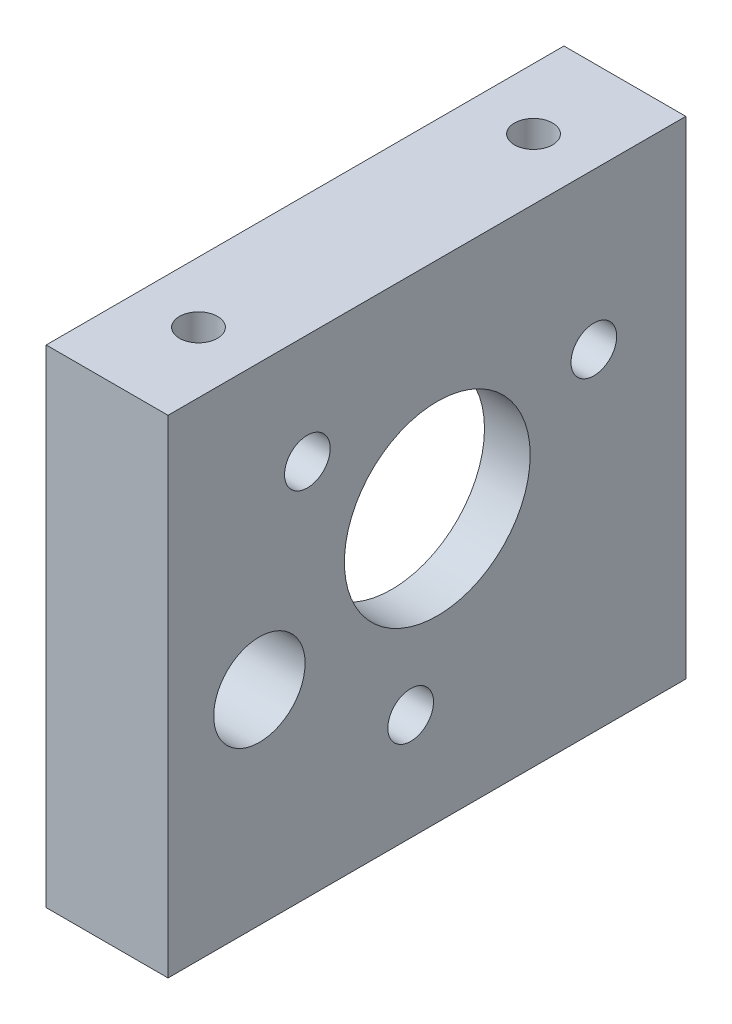
ISO-10303-21;
HEADER;
FILE_DESCRIPTION(('STEP AP214'),'2;1');
FILE_NAME('part.step','',(''),(''),'','','');
FILE_SCHEMA(('AUTOMOTIVE_DESIGN { 1 0 10303 214 1 1 1 1 }'));
ENDSEC;
DATA;
#1=APPLICATION_CONTEXT('core data for automotive mechanical design processes');
#2=APPLICATION_PROTOCOL_DEFINITION('international standard','automotive_design',2000,#1);
#3=PRODUCT_CONTEXT('',#1,'mechanical');
#4=PRODUCT('Part','Part','',(#3));
#5=PRODUCT_RELATED_PRODUCT_CATEGORY('part','',(#4));
#6=PRODUCT_DEFINITION_FORMATION('','',#4);
#7=PRODUCT_DEFINITION_CONTEXT('part definition',#1,'design');
#8=PRODUCT_DEFINITION('design','',#6,#7);
#9=PRODUCT_DEFINITION_SHAPE('','',#8);
#10=(LENGTH_UNIT() NAMED_UNIT(*) SI_UNIT(.MILLI.,.METRE.));
#11=(NAMED_UNIT(*) PLANE_ANGLE_UNIT() SI_UNIT($,.RADIAN.));
#12=(NAMED_UNIT(*) SI_UNIT($,.STERADIAN.) SOLID_ANGLE_UNIT());
#13=UNCERTAINTY_MEASURE_WITH_UNIT(LENGTH_MEASURE(1.E-05),#10,'distance_accuracy_value','');
#14=(GEOMETRIC_REPRESENTATION_CONTEXT(3) GLOBAL_UNCERTAINTY_ASSIGNED_CONTEXT((#13)) GLOBAL_UNIT_ASSIGNED_CONTEXT((#10,
#11,#12)) REPRESENTATION_CONTEXT('',''));
#15=CARTESIAN_POINT('',(0.,0.,0.));
#16=DIRECTION('',(0.,0.,1.));
#17=DIRECTION('',(1.,0.,0.));
#18=AXIS2_PLACEMENT_3D('',#15,#16,#17);
#19=CARTESIAN_POINT('',(0.,0.,0.));
#20=DIRECTION('',(-1.,0.,0.));
#21=DIRECTION('',(0.,0.,1.));
#22=AXIS2_PLACEMENT_3D('',#19,#20,#21);
#23=PLANE('',#22);
#24=DIRECTION('',(0.,-1.,0.));
#25=VECTOR('',#24,1.);
#26=CARTESIAN_POINT('',(0.,0.,0.));
#27=LINE('',#26,#25);
#28=CARTESIAN_POINT('',(0.,32.,0.));
#29=VERTEX_POINT('',#28);
#30=CARTESIAN_POINT('',(0.,0.,0.));
#31=VERTEX_POINT('',#30);
#32=EDGE_CURVE('E297',#29,#31,#27,.T.);
#33=ORIENTED_EDGE('',*,*,#32,.F.);
#34=DIRECTION('',(0.,0.,1.));
#35=VECTOR('',#34,1.);
#36=CARTESIAN_POINT('',(0.,32.,0.));
#37=LINE('',#36,#35);
#38=CARTESIAN_POINT('',(0.,32.,-34.));
#39=VERTEX_POINT('',#38);
#40=EDGE_CURVE('E83',#39,#29,#37,.T.);
#41=ORIENTED_EDGE('',*,*,#40,.F.);
#42=DIRECTION('',(0.,1.,0.));
#43=VECTOR('',#42,1.);
#44=CARTESIAN_POINT('',(0.,0.,-34.));
#45=LINE('',#44,#43);
#46=CARTESIAN_POINT('',(0.,0.,-34.));
#47=VERTEX_POINT('',#46);
#48=EDGE_CURVE('E309',#47,#39,#45,.T.);
#49=ORIENTED_EDGE('',*,*,#48,.F.);
#50=DIRECTION('',(0.,0.,-1.));
#51=VECTOR('',#50,1.);
#52=CARTESIAN_POINT('',(0.,0.,0.));
#53=LINE('',#52,#51);
#54=EDGE_CURVE('E307',#31,#47,#53,.T.);
#55=ORIENTED_EDGE('',*,*,#54,.F.);
#56=EDGE_LOOP('',(#33,#41,#49,#55));
#57=FACE_BOUND('',#56,.T.);
#58=CARTESIAN_POINT('',(0.,13.4,-6.));
#59=DIRECTION('',(-1.,0.,0.));
#60=DIRECTION('',(0.,0.,1.));
#61=AXIS2_PLACEMENT_3D('',#58,#59,#60);
#62=CIRCLE('',#61,3.);
#63=CARTESIAN_POINT('',(0.,13.4,-3.));
#64=VERTEX_POINT('',#63);
#65=EDGE_CURVE('E288',#64,#64,#62,.F.);
#66=ORIENTED_EDGE('',*,*,#65,.T.);
#67=EDGE_LOOP('',(#66));
#68=FACE_BOUND('',#67,.T.);
#69=CARTESIAN_POINT('',(0.,21.8852813742386,-9.));
#70=DIRECTION('',(1.,0.,0.));
#71=DIRECTION('',(0.,0.,1.));
#72=AXIS2_PLACEMENT_3D('',#69,#70,#71);
#73=CIRCLE('',#72,3.);
#74=CARTESIAN_POINT('',(0.,21.8852813742386,-6.));
#75=VERTEX_POINT('',#74);
#76=CARTESIAN_POINT('',(0.,19.0568542494924,-8.));
#77=VERTEX_POINT('',#76);
#78=EDGE_CURVE('E204',#75,#77,#73,.T.);
#79=ORIENTED_EDGE('',*,*,#78,.T.);
#80=CARTESIAN_POINT('',(0.,13.4,-6.));
#81=DIRECTION('',(-1.,0.,0.));
#82=DIRECTION('',(0.,0.,-1.));
#83=AXIS2_PLACEMENT_3D('',#80,#81,#82);
#84=CIRCLE('',#83,6.);
#85=CARTESIAN_POINT('',(0.,13.4,-12.));
#86=VERTEX_POINT('',#85);
#87=EDGE_CURVE('E53',#77,#86,#84,.T.);
#88=ORIENTED_EDGE('',*,*,#87,.T.);
#89=DIRECTION('',(0.,-1.,0.));
#90=VECTOR('',#89,1.);
#91=CARTESIAN_POINT('',(0.,7.,-12.));
#92=LINE('',#91,#90);
#93=CARTESIAN_POINT('',(0.,7.,-12.));
#94=VERTEX_POINT('',#93);
#95=EDGE_CURVE('E226',#86,#94,#92,.T.);
#96=ORIENTED_EDGE('',*,*,#95,.T.);
#97=CARTESIAN_POINT('',(0.,7.,-15.));
#98=DIRECTION('',(1.,0.,0.));
#99=DIRECTION('',(0.,0.,1.));
#100=AXIS2_PLACEMENT_3D('',#97,#98,#99);
#101=CIRCLE('',#100,3.);
#102=CARTESIAN_POINT('',(0.,4.,-15.));
#103=VERTEX_POINT('',#102);
#104=EDGE_CURVE('E229',#94,#103,#101,.T.);
#105=ORIENTED_EDGE('',*,*,#104,.T.);
#106=DIRECTION('',(0.,0.,-1.));
#107=VECTOR('',#106,1.);
#108=CARTESIAN_POINT('',(0.,4.,-29.));
#109=LINE('',#108,#107);
#110=CARTESIAN_POINT('',(0.,4.,-29.));
#111=VERTEX_POINT('',#110);
#112=EDGE_CURVE('E232',#103,#111,#109,.T.);
#113=ORIENTED_EDGE('',*,*,#112,.T.);
#114=CARTESIAN_POINT('',(0.,7.,-29.));
#115=DIRECTION('',(1.,0.,0.));
#116=DIRECTION('',(0.,0.,1.));
#117=AXIS2_PLACEMENT_3D('',#114,#115,#116);
#118=CIRCLE('',#117,3.);
#119=CARTESIAN_POINT('',(0.,7.00000000000002,-32.));
#120=VERTEX_POINT('',#119);
#121=EDGE_CURVE('E235',#111,#120,#118,.T.);
#122=ORIENTED_EDGE('',*,*,#121,.T.);
#123=DIRECTION('',(0.,1.,0.));
#124=VECTOR('',#123,1.);
#125=CARTESIAN_POINT('',(0.,25.,-32.));
#126=LINE('',#125,#124);
#127=CARTESIAN_POINT('',(0.,25.,-32.));
#128=VERTEX_POINT('',#127);
#129=EDGE_CURVE('E238',#120,#128,#126,.T.);
#130=ORIENTED_EDGE('',*,*,#129,.T.);
#131=CARTESIAN_POINT('',(0.,25.,-29.));
#132=DIRECTION('',(1.,0.,0.));
#133=DIRECTION('',(0.,0.,-1.));
#134=AXIS2_PLACEMENT_3D('',#131,#132,#133);
#135=CIRCLE('',#134,3.);
#136=CARTESIAN_POINT('',(0.,28.,-29.));
#137=VERTEX_POINT('',#136);
#138=EDGE_CURVE('E241',#128,#137,#135,.T.);
#139=ORIENTED_EDGE('',*,*,#138,.T.);
#140=DIRECTION('',(0.,0.,1.));
#141=VECTOR('',#140,1.);
#142=CARTESIAN_POINT('',(0.,28.,-9.));
#143=LINE('',#142,#141);
#144=CARTESIAN_POINT('',(0.,28.,-9.));
#145=VERTEX_POINT('',#144);
#146=EDGE_CURVE('E244',#137,#145,#143,.T.);
#147=ORIENTED_EDGE('',*,*,#146,.T.);
#148=CARTESIAN_POINT('',(0.,25.,-9.));
#149=DIRECTION('',(1.,0.,0.));
#150=DIRECTION('',(0.,0.,1.));
#151=AXIS2_PLACEMENT_3D('',#148,#149,#150);
#152=CIRCLE('',#151,3.);
#153=CARTESIAN_POINT('',(0.,25.,-6.));
#154=VERTEX_POINT('',#153);
#155=EDGE_CURVE('E247',#145,#154,#152,.T.);
#156=ORIENTED_EDGE('',*,*,#155,.T.);
#157=DIRECTION('',(0.,-1.,0.));
#158=VECTOR('',#157,1.);
#159=CARTESIAN_POINT('',(0.,21.8852813742386,-6.));
#160=LINE('',#159,#158);
#161=EDGE_CURVE('E250',#154,#75,#160,.T.);
#162=ORIENTED_EDGE('',*,*,#161,.T.);
#163=EDGE_LOOP('',(#79,#88,#96,#105,#113,#122,#130,#139,#147,#156,#162));
#164=FACE_BOUND('',#163,.T.);
#165=ADVANCED_FACE('F37',(#57,#68,#164),#23,.T.);
#166=CARTESIAN_POINT('',(-0.000999999999999265,6.98982565886287,-15.9327571658744));
#167=DIRECTION('',(1.,0.,0.));
#168=DIRECTION('',(0.,-0.866025403784443,0.499999999999992));
#169=AXIS2_PLACEMENT_3D('',#166,#167,#168);
#170=CYLINDRICAL_SURFACE('',#169,1.50000000000001);
#171=CARTESIAN_POINT('',(5.,6.98982565886287,-15.9327571658744));
#172=DIRECTION('',(1.,0.,0.));
#173=DIRECTION('',(0.,0.,-1.));
#174=AXIS2_PLACEMENT_3D('',#171,#172,#173);
#175=CIRCLE('',#174,1.50000000000001);
#176=CARTESIAN_POINT('',(5.,6.98982565886287,-17.4327571658744));
#177=VERTEX_POINT('',#176);
#178=EDGE_CURVE('E282',#177,#177,#175,.F.);
#179=ORIENTED_EDGE('',*,*,#178,.T.);
#180=EDGE_LOOP('',(#179));
#181=FACE_BOUND('',#180,.T.);
#182=CARTESIAN_POINT('',(8.,6.98982565886287,-15.9327571658744));
#183=DIRECTION('',(1.,0.,0.));
#184=DIRECTION('',(0.,-0.866025403784443,0.499999999999992));
#185=AXIS2_PLACEMENT_3D('',#182,#183,#184);
#186=CIRCLE('',#185,1.50000000000001);
#187=CARTESIAN_POINT('',(8.,5.6907875531862,-15.1827571658744));
#188=VERTEX_POINT('',#187);
#189=EDGE_CURVE('E11',#188,#188,#186,.T.);
#190=ORIENTED_EDGE('',*,*,#189,.T.);
#191=EDGE_LOOP('',(#190));
#192=FACE_BOUND('',#191,.T.);
#193=ADVANCED_FACE('F39',(#181,#192),#170,.F.);
#194=CARTESIAN_POINT('',(-0.000999999999999265,24.7941743411371,-9.15004620343455));
#195=DIRECTION('',(1.,0.,0.));
#196=DIRECTION('',(0.,0.866025403784436,0.500000000000004));
#197=AXIS2_PLACEMENT_3D('',#194,#195,#196);
#198=CYLINDRICAL_SURFACE('',#197,1.50000000000001);
#199=CARTESIAN_POINT('',(5.,24.7941743411371,-9.15004620343455));
#200=DIRECTION('',(1.,0.,0.));
#201=DIRECTION('',(0.,0.,-1.));
#202=AXIS2_PLACEMENT_3D('',#199,#200,#201);
#203=CIRCLE('',#202,1.50000000000001);
#204=CARTESIAN_POINT('',(5.,24.7941743411371,-10.6500462034346));
#205=VERTEX_POINT('',#204);
#206=EDGE_CURVE('E279',#205,#205,#203,.F.);
#207=ORIENTED_EDGE('',*,*,#206,.T.);
#208=EDGE_LOOP('',(#207));
#209=FACE_BOUND('',#208,.T.);
#210=CARTESIAN_POINT('',(8.,24.7941743411371,-9.15004620343455));
#211=DIRECTION('',(1.,0.,0.));
#212=DIRECTION('',(0.,0.866025403784436,0.500000000000004));
#213=AXIS2_PLACEMENT_3D('',#210,#211,#212);
#214=CIRCLE('',#213,1.50000000000001);
#215=CARTESIAN_POINT('',(8.,26.0932124468137,-8.40004620343454));
#216=VERTEX_POINT('',#215);
#217=EDGE_CURVE('E46',#216,#216,#214,.T.);
#218=ORIENTED_EDGE('',*,*,#217,.T.);
#219=EDGE_LOOP('',(#218));
#220=FACE_BOUND('',#219,.T.);
#221=ADVANCED_FACE('F323',(#209,#220),#198,.F.);
#222=CARTESIAN_POINT('',(8.,0.,0.));
#223=DIRECTION('',(0.,0.,-1.));
#224=DIRECTION('',(-1.,0.,0.));
#225=AXIS2_PLACEMENT_3D('',#222,#223,#224);
#226=PLANE('',#225);
#227=ORIENTED_EDGE('',*,*,#32,.T.);
#228=DIRECTION('',(-1.,0.,0.));
#229=VECTOR('',#228,1.);
#230=CARTESIAN_POINT('',(8.,0.,0.));
#231=LINE('',#230,#229);
#232=CARTESIAN_POINT('',(8.,0.,0.));
#233=VERTEX_POINT('',#232);
#234=EDGE_CURVE('E318',#233,#31,#231,.T.);
#235=ORIENTED_EDGE('',*,*,#234,.F.);
#236=DIRECTION('',(0.,-1.,0.));
#237=VECTOR('',#236,1.);
#238=CARTESIAN_POINT('',(8.,0.,0.));
#239=LINE('',#238,#237);
#240=CARTESIAN_POINT('',(8.,32.,0.));
#241=VERTEX_POINT('',#240);
#242=EDGE_CURVE('E298',#241,#233,#239,.T.);
#243=ORIENTED_EDGE('',*,*,#242,.F.);
#244=DIRECTION('',(-1.,0.,0.));
#245=VECTOR('',#244,1.);
#246=CARTESIAN_POINT('',(8.,32.,0.));
#247=LINE('',#246,#245);
#248=EDGE_CURVE('E304',#241,#29,#247,.T.);
#249=ORIENTED_EDGE('',*,*,#248,.T.);
#250=EDGE_LOOP('',(#227,#235,#243,#249));
#251=FACE_BOUND('',#250,.T.);
#252=ADVANCED_FACE('F340',(#251),#226,.F.);
#253=CARTESIAN_POINT('',(8.,0.,0.));
#254=DIRECTION('',(0.,1.,0.));
#255=DIRECTION('',(0.,0.,1.));
#256=AXIS2_PLACEMENT_3D('',#253,#254,#255);
#257=PLANE('',#256);
#258=CARTESIAN_POINT('',(4.,0.,-6.));
#259=DIRECTION('',(0.,-1.,0.));
#260=DIRECTION('',(0.,0.,-1.));
#261=AXIS2_PLACEMENT_3D('',#258,#259,#260);
#262=CIRCLE('',#261,1.24999999999999);
#263=CARTESIAN_POINT('',(4.,0.,-7.24999999999999));
#264=VERTEX_POINT('',#263);
#265=EDGE_CURVE('E178',#264,#264,#262,.T.);
#266=ORIENTED_EDGE('',*,*,#265,.F.);
#267=EDGE_LOOP('',(#266));
#268=FACE_BOUND('',#267,.T.);
#269=CARTESIAN_POINT('',(4.,0.,-28.));
#270=DIRECTION('',(0.,-1.,0.));
#271=DIRECTION('',(0.,0.,-1.));
#272=AXIS2_PLACEMENT_3D('',#269,#270,#271);
#273=CIRCLE('',#272,1.24999999999999);
#274=CARTESIAN_POINT('',(4.,0.,-29.25));
#275=VERTEX_POINT('',#274);
#276=EDGE_CURVE('E177',#275,#275,#273,.T.);
#277=ORIENTED_EDGE('',*,*,#276,.F.);
#278=EDGE_LOOP('',(#277));
#279=FACE_BOUND('',#278,.T.);
#280=ORIENTED_EDGE('',*,*,#54,.T.);
#281=DIRECTION('',(-1.,0.,0.));
#282=VECTOR('',#281,1.);
#283=CARTESIAN_POINT('',(8.,0.,-34.));
#284=LINE('',#283,#282);
#285=CARTESIAN_POINT('',(8.,0.,-34.));
#286=VERTEX_POINT('',#285);
#287=EDGE_CURVE('E315',#286,#47,#284,.T.);
#288=ORIENTED_EDGE('',*,*,#287,.F.);
#289=DIRECTION('',(0.,0.,-1.));
#290=VECTOR('',#289,1.);
#291=CARTESIAN_POINT('',(8.,0.,0.));
#292=LINE('',#291,#290);
#293=EDGE_CURVE('E91',#233,#286,#292,.T.);
#294=ORIENTED_EDGE('',*,*,#293,.F.);
#295=ORIENTED_EDGE('',*,*,#234,.T.);
#296=EDGE_LOOP('',(#280,#288,#294,#295));
#297=FACE_BOUND('',#296,.T.);
#298=ADVANCED_FACE('F342',(#268,#279,#297),#257,.F.);
#299=CARTESIAN_POINT('',(8.,0.,-34.));
#300=DIRECTION('',(0.,0.,1.));
#301=DIRECTION('',(1.,0.,0.));
#302=AXIS2_PLACEMENT_3D('',#299,#300,#301);
#303=PLANE('',#302);
#304=ORIENTED_EDGE('',*,*,#48,.T.);
#305=DIRECTION('',(-1.,0.,0.));
#306=VECTOR('',#305,1.);
#307=CARTESIAN_POINT('',(8.,32.,-34.));
#308=LINE('',#307,#306);
#309=CARTESIAN_POINT('',(8.,32.,-34.));
#310=VERTEX_POINT('',#309);
#311=EDGE_CURVE('E313',#310,#39,#308,.T.);
#312=ORIENTED_EDGE('',*,*,#311,.F.);
#313=DIRECTION('',(0.,1.,0.));
#314=VECTOR('',#313,1.);
#315=CARTESIAN_POINT('',(8.,0.,-34.));
#316=LINE('',#315,#314);
#317=EDGE_CURVE('E301',#286,#310,#316,.T.);
#318=ORIENTED_EDGE('',*,*,#317,.F.);
#319=ORIENTED_EDGE('',*,*,#287,.T.);
#320=EDGE_LOOP('',(#304,#312,#318,#319));
#321=FACE_BOUND('',#320,.T.);
#322=ADVANCED_FACE('F347',(#321),#303,.F.);
#323=CARTESIAN_POINT('',(8.,32.,0.));
#324=DIRECTION('',(0.,-1.,0.));
#325=DIRECTION('',(0.,0.,-1.));
#326=AXIS2_PLACEMENT_3D('',#323,#324,#325);
#327=PLANE('',#326);
#328=CARTESIAN_POINT('',(4.,32.,-6.));
#329=DIRECTION('',(0.,1.,0.));
#330=DIRECTION('',(0.,0.,1.));
#331=AXIS2_PLACEMENT_3D('',#328,#329,#330);
#332=CIRCLE('',#331,1.24999999999999);
#333=CARTESIAN_POINT('',(4.,32.,-4.75000000000001));
#334=VERTEX_POINT('',#333);
#335=EDGE_CURVE('E188',#334,#334,#332,.T.);
#336=ORIENTED_EDGE('',*,*,#335,.F.);
#337=EDGE_LOOP('',(#336));
#338=FACE_BOUND('',#337,.T.);
#339=CARTESIAN_POINT('',(4.,32.,-28.));
#340=DIRECTION('',(0.,1.,0.));
#341=DIRECTION('',(0.,0.,1.));
#342=AXIS2_PLACEMENT_3D('',#339,#340,#341);
#343=CIRCLE('',#342,1.24999999999999);
#344=CARTESIAN_POINT('',(4.,32.,-26.75));
#345=VERTEX_POINT('',#344);
#346=EDGE_CURVE('E194',#345,#345,#343,.T.);
#347=ORIENTED_EDGE('',*,*,#346,.F.);
#348=EDGE_LOOP('',(#347));
#349=FACE_BOUND('',#348,.T.);
#350=ORIENTED_EDGE('',*,*,#40,.T.);
#351=ORIENTED_EDGE('',*,*,#248,.F.);
#352=DIRECTION('',(0.,0.,1.));
#353=VECTOR('',#352,1.);
#354=CARTESIAN_POINT('',(8.,32.,0.));
#355=LINE('',#354,#353);
#356=EDGE_CURVE('E62',#310,#241,#355,.T.);
#357=ORIENTED_EDGE('',*,*,#356,.F.);
#358=ORIENTED_EDGE('',*,*,#311,.T.);
#359=EDGE_LOOP('',(#350,#351,#357,#358));
#360=FACE_BOUND('',#359,.T.);
#361=ADVANCED_FACE('F329',(#338,#349,#360),#327,.F.);
#362=CARTESIAN_POINT('',(8.,0.,0.));
#363=DIRECTION('',(-1.,0.,0.));
#364=DIRECTION('',(0.,0.,1.));
#365=AXIS2_PLACEMENT_3D('',#362,#363,#364);
#366=PLANE('',#365);
#367=ORIENTED_EDGE('',*,*,#189,.F.);
#368=EDGE_LOOP('',(#367));
#369=FACE_BOUND('',#368,.T.);
#370=ORIENTED_EDGE('',*,*,#217,.F.);
#371=EDGE_LOOP('',(#370));
#372=FACE_BOUND('',#371,.T.);
#373=CARTESIAN_POINT('',(8.,21.766,-27.9604199413399));
#374=DIRECTION('',(1.,0.,0.));
#375=DIRECTION('',(0.,0.,-1.));
#376=AXIS2_PLACEMENT_3D('',#373,#374,#375);
#377=CIRCLE('',#376,1.50000000000001);
#378=CARTESIAN_POINT('',(8.,21.766,-29.4604199413399));
#379=VERTEX_POINT('',#378);
#380=EDGE_CURVE('E285',#379,#379,#377,.T.);
#381=ORIENTED_EDGE('',*,*,#380,.F.);
#382=EDGE_LOOP('',(#381));
#383=FACE_BOUND('',#382,.T.);
#384=CARTESIAN_POINT('',(8.,13.4,-6.));
#385=DIRECTION('',(1.,0.,0.));
#386=DIRECTION('',(0.,0.,-1.));
#387=AXIS2_PLACEMENT_3D('',#384,#385,#386);
#388=CIRCLE('',#387,3.);
#389=CARTESIAN_POINT('',(8.,13.4,-9.));
#390=VERTEX_POINT('',#389);
#391=EDGE_CURVE('E289',#390,#390,#388,.T.);
#392=ORIENTED_EDGE('',*,*,#391,.F.);
#393=EDGE_LOOP('',(#392));
#394=FACE_BOUND('',#393,.T.);
#395=CARTESIAN_POINT('',(8.,17.85,-17.6810744368829));
#396=DIRECTION('',(1.,0.,0.));
#397=DIRECTION('',(0.,0.,-1.));
#398=AXIS2_PLACEMENT_3D('',#395,#396,#397);
#399=CIRCLE('',#398,6.10000000000001);
#400=CARTESIAN_POINT('',(8.,17.85,-23.7810744368829));
#401=VERTEX_POINT('',#400);
#402=EDGE_CURVE('E292',#401,#401,#399,.T.);
#403=ORIENTED_EDGE('',*,*,#402,.F.);
#404=EDGE_LOOP('',(#403));
#405=FACE_BOUND('',#404,.T.);
#406=ORIENTED_EDGE('',*,*,#242,.T.);
#407=ORIENTED_EDGE('',*,*,#293,.T.);
#408=ORIENTED_EDGE('',*,*,#317,.T.);
#409=ORIENTED_EDGE('',*,*,#356,.T.);
#410=EDGE_LOOP('',(#406,#407,#408,#409));
#411=FACE_BOUND('',#410,.T.);
#412=ADVANCED_FACE('F325',(#369,#372,#383,#394,#405,#411),#366,.F.);
#413=CARTESIAN_POINT('',(-0.000999999999999265,17.85,-17.6810744368829));
#414=DIRECTION('',(1.,0.,0.));
#415=DIRECTION('',(0.,0.,-1.));
#416=AXIS2_PLACEMENT_3D('',#413,#414,#415);
#417=CYLINDRICAL_SURFACE('',#416,6.10000000000001);
#418=CARTESIAN_POINT('',(5.,17.85,-17.6810744368829));
#419=DIRECTION('',(1.,0.,0.));
#420=DIRECTION('',(0.,0.,-1.));
#421=AXIS2_PLACEMENT_3D('',#418,#419,#420);
#422=CIRCLE('',#421,6.10000000000001);
#423=CARTESIAN_POINT('',(5.,17.85,-23.7810744368829));
#424=VERTEX_POINT('',#423);
#425=EDGE_CURVE('E276',#424,#424,#422,.F.);
#426=ORIENTED_EDGE('',*,*,#425,.T.);
#427=EDGE_LOOP('',(#426));
#428=FACE_BOUND('',#427,.T.);
#429=ORIENTED_EDGE('',*,*,#402,.T.);
#430=EDGE_LOOP('',(#429));
#431=FACE_BOUND('',#430,.T.);
#432=ADVANCED_FACE('F328',(#428,#431),#417,.F.);
#433=CARTESIAN_POINT('',(-0.000999999999999265,13.4,-6.));
#434=DIRECTION('',(1.,0.,0.));
#435=DIRECTION('',(0.,0.,-1.));
#436=AXIS2_PLACEMENT_3D('',#433,#434,#435);
#437=CYLINDRICAL_SURFACE('',#436,3.);
#438=ORIENTED_EDGE('',*,*,#65,.F.);
#439=EDGE_LOOP('',(#438));
#440=FACE_BOUND('',#439,.T.);
#441=ORIENTED_EDGE('',*,*,#391,.T.);
#442=EDGE_LOOP('',(#441));
#443=FACE_BOUND('',#442,.T.);
#444=ADVANCED_FACE('F437',(#440,#443),#437,.F.);
#445=CARTESIAN_POINT('',(-0.000999999999999265,21.766,-27.9604199413399));
#446=DIRECTION('',(1.,0.,0.));
#447=DIRECTION('',(0.,0.,-1.));
#448=AXIS2_PLACEMENT_3D('',#445,#446,#447);
#449=CYLINDRICAL_SURFACE('',#448,1.50000000000001);
#450=CARTESIAN_POINT('',(5.,21.766,-27.9604199413399));
#451=DIRECTION('',(1.,0.,0.));
#452=DIRECTION('',(0.,0.,-1.));
#453=AXIS2_PLACEMENT_3D('',#450,#451,#452);
#454=CIRCLE('',#453,1.50000000000001);
#455=CARTESIAN_POINT('',(5.,21.766,-29.4604199413399));
#456=VERTEX_POINT('',#455);
#457=EDGE_CURVE('E41',#456,#456,#454,.F.);
#458=ORIENTED_EDGE('',*,*,#457,.T.);
#459=EDGE_LOOP('',(#458));
#460=FACE_BOUND('',#459,.T.);
#461=ORIENTED_EDGE('',*,*,#380,.T.);
#462=EDGE_LOOP('',(#461));
#463=FACE_BOUND('',#462,.T.);
#464=ADVANCED_FACE('F434',(#460,#463),#449,.F.);
#465=CARTESIAN_POINT('',(5.,13.4,-6.));
#466=DIRECTION('',(1.,0.,0.));
#467=DIRECTION('',(0.,0.,-1.));
#468=AXIS2_PLACEMENT_3D('',#465,#466,#467);
#469=PLANE('',#468);
#470=ORIENTED_EDGE('',*,*,#206,.F.);
#471=EDGE_LOOP('',(#470));
#472=FACE_BOUND('',#471,.T.);
#473=ORIENTED_EDGE('',*,*,#457,.F.);
#474=EDGE_LOOP('',(#473));
#475=FACE_BOUND('',#474,.T.);
#476=CARTESIAN_POINT('',(5.,13.4,-6.));
#477=DIRECTION('',(-1.,0.,0.));
#478=DIRECTION('',(0.,0.,-1.));
#479=AXIS2_PLACEMENT_3D('',#476,#477,#478);
#480=CIRCLE('',#479,6.);
#481=CARTESIAN_POINT('',(5.,19.0568542494924,-8.));
#482=VERTEX_POINT('',#481);
#483=CARTESIAN_POINT('',(5.,13.4,-12.));
#484=VERTEX_POINT('',#483);
#485=EDGE_CURVE('E200',#482,#484,#480,.T.);
#486=ORIENTED_EDGE('',*,*,#485,.F.);
#487=CARTESIAN_POINT('',(5.,21.8852813742386,-9.));
#488=DIRECTION('',(1.,0.,0.));
#489=DIRECTION('',(0.,0.,1.));
#490=AXIS2_PLACEMENT_3D('',#487,#488,#489);
#491=CIRCLE('',#490,3.);
#492=CARTESIAN_POINT('',(5.,21.8852813742386,-6.));
#493=VERTEX_POINT('',#492);
#494=EDGE_CURVE('E222',#493,#482,#491,.T.);
#495=ORIENTED_EDGE('',*,*,#494,.F.);
#496=DIRECTION('',(0.,-1.,0.));
#497=VECTOR('',#496,1.);
#498=CARTESIAN_POINT('',(5.,21.8852813742386,-6.));
#499=LINE('',#498,#497);
#500=CARTESIAN_POINT('',(5.,25.,-6.));
#501=VERTEX_POINT('',#500);
#502=EDGE_CURVE('E220',#501,#493,#499,.T.);
#503=ORIENTED_EDGE('',*,*,#502,.F.);
#504=CARTESIAN_POINT('',(5.,25.,-9.));
#505=DIRECTION('',(1.,0.,0.));
#506=DIRECTION('',(0.,0.,1.));
#507=AXIS2_PLACEMENT_3D('',#504,#505,#506);
#508=CIRCLE('',#507,3.);
#509=CARTESIAN_POINT('',(5.,28.,-9.));
#510=VERTEX_POINT('',#509);
#511=EDGE_CURVE('E218',#510,#501,#508,.T.);
#512=ORIENTED_EDGE('',*,*,#511,.F.);
#513=DIRECTION('',(0.,0.,1.));
#514=VECTOR('',#513,1.);
#515=CARTESIAN_POINT('',(5.,28.,-9.));
#516=LINE('',#515,#514);
#517=CARTESIAN_POINT('',(5.,28.,-29.));
#518=VERTEX_POINT('',#517);
#519=EDGE_CURVE('E216',#518,#510,#516,.T.);
#520=ORIENTED_EDGE('',*,*,#519,.F.);
#521=CARTESIAN_POINT('',(5.,25.,-29.));
#522=DIRECTION('',(1.,0.,0.));
#523=DIRECTION('',(0.,0.,-1.));
#524=AXIS2_PLACEMENT_3D('',#521,#522,#523);
#525=CIRCLE('',#524,3.);
#526=CARTESIAN_POINT('',(5.,25.,-32.));
#527=VERTEX_POINT('',#526);
#528=EDGE_CURVE('E214',#527,#518,#525,.T.);
#529=ORIENTED_EDGE('',*,*,#528,.F.);
#530=DIRECTION('',(0.,1.,0.));
#531=VECTOR('',#530,1.);
#532=CARTESIAN_POINT('',(5.,25.,-32.));
#533=LINE('',#532,#531);
#534=CARTESIAN_POINT('',(5.,7.00000000000002,-32.));
#535=VERTEX_POINT('',#534);
#536=EDGE_CURVE('E212',#535,#527,#533,.T.);
#537=ORIENTED_EDGE('',*,*,#536,.F.);
#538=CARTESIAN_POINT('',(5.,7.,-29.));
#539=DIRECTION('',(1.,0.,0.));
#540=DIRECTION('',(0.,0.,1.));
#541=AXIS2_PLACEMENT_3D('',#538,#539,#540);
#542=CIRCLE('',#541,3.);
#543=CARTESIAN_POINT('',(5.,4.,-29.));
#544=VERTEX_POINT('',#543);
#545=EDGE_CURVE('E210',#544,#535,#542,.T.);
#546=ORIENTED_EDGE('',*,*,#545,.F.);
#547=DIRECTION('',(0.,0.,-1.));
#548=VECTOR('',#547,1.);
#549=CARTESIAN_POINT('',(5.,4.,-29.));
#550=LINE('',#549,#548);
#551=CARTESIAN_POINT('',(5.,4.,-15.));
#552=VERTEX_POINT('',#551);
#553=EDGE_CURVE('E208',#552,#544,#550,.T.);
#554=ORIENTED_EDGE('',*,*,#553,.F.);
#555=CARTESIAN_POINT('',(5.,7.,-15.));
#556=DIRECTION('',(1.,0.,0.));
#557=DIRECTION('',(0.,0.,1.));
#558=AXIS2_PLACEMENT_3D('',#555,#556,#557);
#559=CIRCLE('',#558,3.);
#560=CARTESIAN_POINT('',(5.,7.,-12.));
#561=VERTEX_POINT('',#560);
#562=EDGE_CURVE('E206',#561,#552,#559,.T.);
#563=ORIENTED_EDGE('',*,*,#562,.F.);
#564=DIRECTION('',(0.,-1.,0.));
#565=VECTOR('',#564,1.);
#566=CARTESIAN_POINT('',(5.,7.,-12.));
#567=LINE('',#566,#565);
#568=EDGE_CURVE('E203',#484,#561,#567,.T.);
#569=ORIENTED_EDGE('',*,*,#568,.F.);
#570=EDGE_LOOP('',(#486,#495,#503,#512,#520,#529,#537,#546,#554,#563,#569));
#571=FACE_BOUND('',#570,.T.);
#572=ORIENTED_EDGE('',*,*,#425,.F.);
#573=EDGE_LOOP('',(#572));
#574=FACE_BOUND('',#573,.T.);
#575=ORIENTED_EDGE('',*,*,#178,.F.);
#576=EDGE_LOOP('',(#575));
#577=FACE_BOUND('',#576,.T.);
#578=ADVANCED_FACE('F364',(#472,#475,#571,#574,#577),#469,.F.);
#579=CARTESIAN_POINT('',(5.,13.4,-6.));
#580=DIRECTION('',(-1.,0.,0.));
#581=DIRECTION('',(0.,0.,1.));
#582=AXIS2_PLACEMENT_3D('',#579,#580,#581);
#583=CYLINDRICAL_SURFACE('',#582,6.);
#584=ORIENTED_EDGE('',*,*,#87,.F.);
#585=DIRECTION('',(-1.,0.,0.));
#586=VECTOR('',#585,1.);
#587=CARTESIAN_POINT('',(5.,19.0568542494924,-8.));
#588=LINE('',#587,#586);
#589=EDGE_CURVE('E224',#482,#77,#588,.T.);
#590=ORIENTED_EDGE('',*,*,#589,.F.);
#591=ORIENTED_EDGE('',*,*,#485,.T.);
#592=DIRECTION('',(-1.,0.,0.));
#593=VECTOR('',#592,1.);
#594=CARTESIAN_POINT('',(5.,13.4,-12.));
#595=LINE('',#594,#593);
#596=EDGE_CURVE('E274',#484,#86,#595,.T.);
#597=ORIENTED_EDGE('',*,*,#596,.T.);
#598=EDGE_LOOP('',(#584,#590,#591,#597));
#599=FACE_BOUND('',#598,.T.);
#600=ADVANCED_FACE('F361',(#599),#583,.T.);
#601=CARTESIAN_POINT('',(5.,7.,-12.));
#602=DIRECTION('',(0.,0.,-1.));
#603=DIRECTION('',(-1.,0.,0.));
#604=AXIS2_PLACEMENT_3D('',#601,#602,#603);
#605=PLANE('',#604);
#606=ORIENTED_EDGE('',*,*,#95,.F.);
#607=ORIENTED_EDGE('',*,*,#596,.F.);
#608=ORIENTED_EDGE('',*,*,#568,.T.);
#609=DIRECTION('',(-1.,0.,0.));
#610=VECTOR('',#609,1.);
#611=CARTESIAN_POINT('',(5.,7.,-12.));
#612=LINE('',#611,#610);
#613=EDGE_CURVE('E272',#561,#94,#612,.T.);
#614=ORIENTED_EDGE('',*,*,#613,.T.);
#615=EDGE_LOOP('',(#606,#607,#608,#614));
#616=FACE_BOUND('',#615,.T.);
#617=ADVANCED_FACE('F371',(#616),#605,.T.);
#618=CARTESIAN_POINT('',(5.,7.,-15.));
#619=DIRECTION('',(-1.,0.,0.));
#620=DIRECTION('',(0.,0.,1.));
#621=AXIS2_PLACEMENT_3D('',#618,#619,#620);
#622=CYLINDRICAL_SURFACE('',#621,3.);
#623=ORIENTED_EDGE('',*,*,#104,.F.);
#624=ORIENTED_EDGE('',*,*,#613,.F.);
#625=ORIENTED_EDGE('',*,*,#562,.T.);
#626=DIRECTION('',(-1.,0.,0.));
#627=VECTOR('',#626,1.);
#628=CARTESIAN_POINT('',(5.,4.,-15.));
#629=LINE('',#628,#627);
#630=EDGE_CURVE('E270',#552,#103,#629,.T.);
#631=ORIENTED_EDGE('',*,*,#630,.T.);
#632=EDGE_LOOP('',(#623,#624,#625,#631));
#633=FACE_BOUND('',#632,.T.);
#634=ADVANCED_FACE('F374',(#633),#622,.F.);
#635=CARTESIAN_POINT('',(5.,4.,-29.));
#636=DIRECTION('',(0.,1.,0.));
#637=DIRECTION('',(0.,0.,1.));
#638=AXIS2_PLACEMENT_3D('',#635,#636,#637);
#639=PLANE('',#638);
#640=ORIENTED_EDGE('',*,*,#112,.F.);
#641=ORIENTED_EDGE('',*,*,#630,.F.);
#642=ORIENTED_EDGE('',*,*,#553,.T.);
#643=DIRECTION('',(-1.,0.,0.));
#644=VECTOR('',#643,1.);
#645=CARTESIAN_POINT('',(5.,4.,-29.));
#646=LINE('',#645,#644);
#647=EDGE_CURVE('E268',#544,#111,#646,.T.);
#648=ORIENTED_EDGE('',*,*,#647,.T.);
#649=EDGE_LOOP('',(#640,#641,#642,#648));
#650=FACE_BOUND('',#649,.T.);
#651=ADVANCED_FACE('F379',(#650),#639,.T.);
#652=CARTESIAN_POINT('',(5.,7.,-29.));
#653=DIRECTION('',(-1.,0.,0.));
#654=DIRECTION('',(0.,0.,1.));
#655=AXIS2_PLACEMENT_3D('',#652,#653,#654);
#656=CYLINDRICAL_SURFACE('',#655,3.);
#657=ORIENTED_EDGE('',*,*,#121,.F.);
#658=ORIENTED_EDGE('',*,*,#647,.F.);
#659=ORIENTED_EDGE('',*,*,#545,.T.);
#660=DIRECTION('',(-1.,0.,0.));
#661=VECTOR('',#660,1.);
#662=CARTESIAN_POINT('',(5.,7.00000000000002,-32.));
#663=LINE('',#662,#661);
#664=EDGE_CURVE('E266',#535,#120,#663,.T.);
#665=ORIENTED_EDGE('',*,*,#664,.T.);
#666=EDGE_LOOP('',(#657,#658,#659,#665));
#667=FACE_BOUND('',#666,.T.);
#668=ADVANCED_FACE('F383',(#667),#656,.F.);
#669=CARTESIAN_POINT('',(5.,25.,-32.));
#670=DIRECTION('',(0.,0.,1.));
#671=DIRECTION('',(1.,0.,0.));
#672=AXIS2_PLACEMENT_3D('',#669,#670,#671);
#673=PLANE('',#672);
#674=ORIENTED_EDGE('',*,*,#129,.F.);
#675=ORIENTED_EDGE('',*,*,#664,.F.);
#676=ORIENTED_EDGE('',*,*,#536,.T.);
#677=DIRECTION('',(-1.,0.,0.));
#678=VECTOR('',#677,1.);
#679=CARTESIAN_POINT('',(5.,25.,-32.));
#680=LINE('',#679,#678);
#681=EDGE_CURVE('E264',#527,#128,#680,.T.);
#682=ORIENTED_EDGE('',*,*,#681,.T.);
#683=EDGE_LOOP('',(#674,#675,#676,#682));
#684=FACE_BOUND('',#683,.T.);
#685=ADVANCED_FACE('F388',(#684),#673,.T.);
#686=CARTESIAN_POINT('',(5.,25.,-29.));
#687=DIRECTION('',(-1.,0.,0.));
#688=DIRECTION('',(0.,0.,1.));
#689=AXIS2_PLACEMENT_3D('',#686,#687,#688);
#690=CYLINDRICAL_SURFACE('',#689,3.);
#691=ORIENTED_EDGE('',*,*,#138,.F.);
#692=ORIENTED_EDGE('',*,*,#681,.F.);
#693=ORIENTED_EDGE('',*,*,#528,.T.);
#694=DIRECTION('',(-1.,0.,0.));
#695=VECTOR('',#694,1.);
#696=CARTESIAN_POINT('',(5.,28.,-29.));
#697=LINE('',#696,#695);
#698=EDGE_CURVE('E262',#518,#137,#697,.T.);
#699=ORIENTED_EDGE('',*,*,#698,.T.);
#700=EDGE_LOOP('',(#691,#692,#693,#699));
#701=FACE_BOUND('',#700,.T.);
#702=ADVANCED_FACE('F393',(#701),#690,.F.);
#703=CARTESIAN_POINT('',(5.,28.,-9.));
#704=DIRECTION('',(0.,-1.,0.));
#705=DIRECTION('',(0.,0.,-1.));
#706=AXIS2_PLACEMENT_3D('',#703,#704,#705);
#707=PLANE('',#706);
#708=ORIENTED_EDGE('',*,*,#146,.F.);
#709=ORIENTED_EDGE('',*,*,#698,.F.);
#710=ORIENTED_EDGE('',*,*,#519,.T.);
#711=DIRECTION('',(-1.,0.,0.));
#712=VECTOR('',#711,1.);
#713=CARTESIAN_POINT('',(5.,28.,-9.));
#714=LINE('',#713,#712);
#715=EDGE_CURVE('E260',#510,#145,#714,.T.);
#716=ORIENTED_EDGE('',*,*,#715,.T.);
#717=EDGE_LOOP('',(#708,#709,#710,#716));
#718=FACE_BOUND('',#717,.T.);
#719=ADVANCED_FACE('F398',(#718),#707,.T.);
#720=CARTESIAN_POINT('',(5.,25.,-9.));
#721=DIRECTION('',(-1.,0.,0.));
#722=DIRECTION('',(0.,0.,1.));
#723=AXIS2_PLACEMENT_3D('',#720,#721,#722);
#724=CYLINDRICAL_SURFACE('',#723,3.);
#725=ORIENTED_EDGE('',*,*,#155,.F.);
#726=ORIENTED_EDGE('',*,*,#715,.F.);
#727=ORIENTED_EDGE('',*,*,#511,.T.);
#728=DIRECTION('',(-1.,0.,0.));
#729=VECTOR('',#728,1.);
#730=CARTESIAN_POINT('',(5.,25.,-6.));
#731=LINE('',#730,#729);
#732=EDGE_CURVE('E258',#501,#154,#731,.T.);
#733=ORIENTED_EDGE('',*,*,#732,.T.);
#734=EDGE_LOOP('',(#725,#726,#727,#733));
#735=FACE_BOUND('',#734,.T.);
#736=ADVANCED_FACE('F403',(#735),#724,.F.);
#737=CARTESIAN_POINT('',(5.,21.8852813742386,-6.));
#738=DIRECTION('',(0.,0.,-1.));
#739=DIRECTION('',(0.,1.,0.));
#740=AXIS2_PLACEMENT_3D('',#737,#738,#739);
#741=PLANE('',#740);
#742=ORIENTED_EDGE('',*,*,#161,.F.);
#743=ORIENTED_EDGE('',*,*,#732,.F.);
#744=ORIENTED_EDGE('',*,*,#502,.T.);
#745=DIRECTION('',(-1.,0.,0.));
#746=VECTOR('',#745,1.);
#747=CARTESIAN_POINT('',(5.,21.8852813742386,-6.));
#748=LINE('',#747,#746);
#749=EDGE_CURVE('E256',#493,#75,#748,.T.);
#750=ORIENTED_EDGE('',*,*,#749,.T.);
#751=EDGE_LOOP('',(#742,#743,#744,#750));
#752=FACE_BOUND('',#751,.T.);
#753=ADVANCED_FACE('F406',(#752),#741,.T.);
#754=CARTESIAN_POINT('',(5.,21.8852813742386,-9.));
#755=DIRECTION('',(-1.,0.,0.));
#756=DIRECTION('',(0.,0.,1.));
#757=AXIS2_PLACEMENT_3D('',#754,#755,#756);
#758=CYLINDRICAL_SURFACE('',#757,3.);
#759=ORIENTED_EDGE('',*,*,#78,.F.);
#760=ORIENTED_EDGE('',*,*,#749,.F.);
#761=ORIENTED_EDGE('',*,*,#494,.T.);
#762=ORIENTED_EDGE('',*,*,#589,.T.);
#763=EDGE_LOOP('',(#759,#760,#761,#762));
#764=FACE_BOUND('',#763,.T.);
#765=ADVANCED_FACE('F358',(#764),#758,.F.);
#766=CARTESIAN_POINT('',(4.,29.,-28.));
#767=DIRECTION('',(0.,1.,0.));
#768=DIRECTION('',(0.,0.,1.));
#769=AXIS2_PLACEMENT_3D('',#766,#767,#768);
#770=CONICAL_SURFACE('',#769,1.25,1.02974425867665);
#771=CARTESIAN_POINT('',(4.,28.2489242262155,-28.));
#772=VERTEX_POINT('',#771);
#773=VERTEX_LOOP('',#772);
#774=FACE_BOUND('',#773,.T.);
#775=CARTESIAN_POINT('',(4.,29.,-28.));
#776=DIRECTION('',(0.,1.,0.));
#777=DIRECTION('',(0.,0.,1.));
#778=AXIS2_PLACEMENT_3D('',#775,#776,#777);
#779=CIRCLE('',#778,1.25);
#780=CARTESIAN_POINT('',(4.,29.,-26.75));
#781=VERTEX_POINT('',#780);
#782=EDGE_CURVE('E197',#781,#781,#779,.T.);
#783=ORIENTED_EDGE('',*,*,#782,.T.);
#784=EDGE_LOOP('',(#783));
#785=FACE_BOUND('',#784,.T.);
#786=ADVANCED_FACE('F413',(#774,#785),#770,.F.);
#787=CARTESIAN_POINT('',(4.,32.,-28.));
#788=DIRECTION('',(0.,1.,0.));
#789=DIRECTION('',(0.,0.,1.));
#790=AXIS2_PLACEMENT_3D('',#787,#788,#789);
#791=CYLINDRICAL_SURFACE('',#790,1.24999999999999);
#792=ORIENTED_EDGE('',*,*,#782,.F.);
#793=EDGE_LOOP('',(#792));
#794=FACE_BOUND('',#793,.T.);
#795=ORIENTED_EDGE('',*,*,#346,.T.);
#796=EDGE_LOOP('',(#795));
#797=FACE_BOUND('',#796,.T.);
#798=ADVANCED_FACE('F472',(#794,#797),#791,.F.);
#799=CARTESIAN_POINT('',(4.,29.,-6.));
#800=DIRECTION('',(0.,1.,0.));
#801=DIRECTION('',(0.,0.,1.));
#802=AXIS2_PLACEMENT_3D('',#799,#800,#801);
#803=CONICAL_SURFACE('',#802,1.25,1.02974425867665);
#804=CARTESIAN_POINT('',(4.,28.2489242262155,-6.));
#805=VERTEX_POINT('',#804);
#806=VERTEX_LOOP('',#805);
#807=FACE_BOUND('',#806,.T.);
#808=CARTESIAN_POINT('',(4.,29.,-6.));
#809=DIRECTION('',(0.,1.,0.));
#810=DIRECTION('',(0.,0.,1.));
#811=AXIS2_PLACEMENT_3D('',#808,#809,#810);
#812=CIRCLE('',#811,1.25);
#813=CARTESIAN_POINT('',(4.,29.,-4.75));
#814=VERTEX_POINT('',#813);
#815=EDGE_CURVE('E191',#814,#814,#812,.T.);
#816=ORIENTED_EDGE('',*,*,#815,.T.);
#817=EDGE_LOOP('',(#816));
#818=FACE_BOUND('',#817,.T.);
#819=ADVANCED_FACE('F476',(#807,#818),#803,.F.);
#820=CARTESIAN_POINT('',(4.,32.,-6.));
#821=DIRECTION('',(0.,1.,0.));
#822=DIRECTION('',(0.,0.,1.));
#823=AXIS2_PLACEMENT_3D('',#820,#821,#822);
#824=CYLINDRICAL_SURFACE('',#823,1.24999999999999);
#825=ORIENTED_EDGE('',*,*,#815,.F.);
#826=EDGE_LOOP('',(#825));
#827=FACE_BOUND('',#826,.T.);
#828=ORIENTED_EDGE('',*,*,#335,.T.);
#829=EDGE_LOOP('',(#828));
#830=FACE_BOUND('',#829,.T.);
#831=ADVANCED_FACE('F480',(#827,#830),#824,.F.);
#832=CARTESIAN_POINT('',(4.,3.,-28.));
#833=DIRECTION('',(0.,-1.,0.));
#834=DIRECTION('',(0.,0.,-1.));
#835=AXIS2_PLACEMENT_3D('',#832,#833,#834);
#836=CONICAL_SURFACE('',#835,1.24999999999999,1.02974425867665);
#837=CARTESIAN_POINT('',(4.,3.75107577378445,-28.));
#838=VERTEX_POINT('',#837);
#839=VERTEX_LOOP('',#838);
#840=FACE_BOUND('',#839,.T.);
#841=CARTESIAN_POINT('',(4.,3.,-28.));
#842=DIRECTION('',(0.,-1.,0.));
#843=DIRECTION('',(0.,0.,-1.));
#844=AXIS2_PLACEMENT_3D('',#841,#842,#843);
#845=CIRCLE('',#844,1.24999999999999);
#846=CARTESIAN_POINT('',(4.,3.,-29.25));
#847=VERTEX_POINT('',#846);
#848=EDGE_CURVE('E181',#847,#847,#845,.T.);
#849=ORIENTED_EDGE('',*,*,#848,.T.);
#850=EDGE_LOOP('',(#849));
#851=FACE_BOUND('',#850,.T.);
#852=ADVANCED_FACE('F484',(#840,#851),#836,.F.);
#853=CARTESIAN_POINT('',(4.,0.,-28.));
#854=DIRECTION('',(0.,-1.,0.));
#855=DIRECTION('',(0.,0.,-1.));
#856=AXIS2_PLACEMENT_3D('',#853,#854,#855);
#857=CYLINDRICAL_SURFACE('',#856,1.24999999999999);
#858=ORIENTED_EDGE('',*,*,#848,.F.);
#859=EDGE_LOOP('',(#858));
#860=FACE_BOUND('',#859,.T.);
#861=ORIENTED_EDGE('',*,*,#276,.T.);
#862=EDGE_LOOP('',(#861));
#863=FACE_BOUND('',#862,.T.);
#864=ADVANCED_FACE('F171',(#860,#863),#857,.F.);
#865=CARTESIAN_POINT('',(4.,3.,-6.));
#866=DIRECTION('',(0.,-1.,0.));
#867=DIRECTION('',(0.,0.,-1.));
#868=AXIS2_PLACEMENT_3D('',#865,#866,#867);
#869=CONICAL_SURFACE('',#868,1.24999999999999,1.02974425867665);
#870=CARTESIAN_POINT('',(4.,3.75107577378445,-6.));
#871=VERTEX_POINT('',#870);
#872=VERTEX_LOOP('',#871);
#873=FACE_BOUND('',#872,.T.);
#874=CARTESIAN_POINT('',(4.,3.,-6.));
#875=DIRECTION('',(0.,-1.,0.));
#876=DIRECTION('',(0.,0.,-1.));
#877=AXIS2_PLACEMENT_3D('',#874,#875,#876);
#878=CIRCLE('',#877,1.24999999999999);
#879=CARTESIAN_POINT('',(4.,3.,-7.24999999999999));
#880=VERTEX_POINT('',#879);
#881=EDGE_CURVE('E175',#880,#880,#878,.T.);
#882=ORIENTED_EDGE('',*,*,#881,.T.);
#883=EDGE_LOOP('',(#882));
#884=FACE_BOUND('',#883,.T.);
#885=ADVANCED_FACE('F167',(#873,#884),#869,.F.);
#886=CARTESIAN_POINT('',(4.,0.,-6.));
#887=DIRECTION('',(0.,-1.,0.));
#888=DIRECTION('',(0.,0.,-1.));
#889=AXIS2_PLACEMENT_3D('',#886,#887,#888);
#890=CYLINDRICAL_SURFACE('',#889,1.24999999999999);
#891=ORIENTED_EDGE('',*,*,#881,.F.);
#892=EDGE_LOOP('',(#891));
#893=FACE_BOUND('',#892,.T.);
#894=ORIENTED_EDGE('',*,*,#265,.T.);
#895=EDGE_LOOP('',(#894));
#896=FACE_BOUND('',#895,.T.);
#897=ADVANCED_FACE('F170',(#893,#896),#890,.F.);
#898=CLOSED_SHELL('',(#165,#193,#221,#252,#298,#322,#361,#412,#432,#444,#464,#578,#600,#617,
#634,#651,#668,#685,#702,#719,#736,#753,#765,#786,#798,#819,#831,#852,#864,#885,#897));
#899=MANIFOLD_SOLID_BREP('B2',#898);
#900=ADVANCED_BREP_SHAPE_REPRESENTATION('',(#18,#899),#14);
#901=SHAPE_DEFINITION_REPRESENTATION(#9,#900);
ENDSEC;
END-ISO-10303-21;
